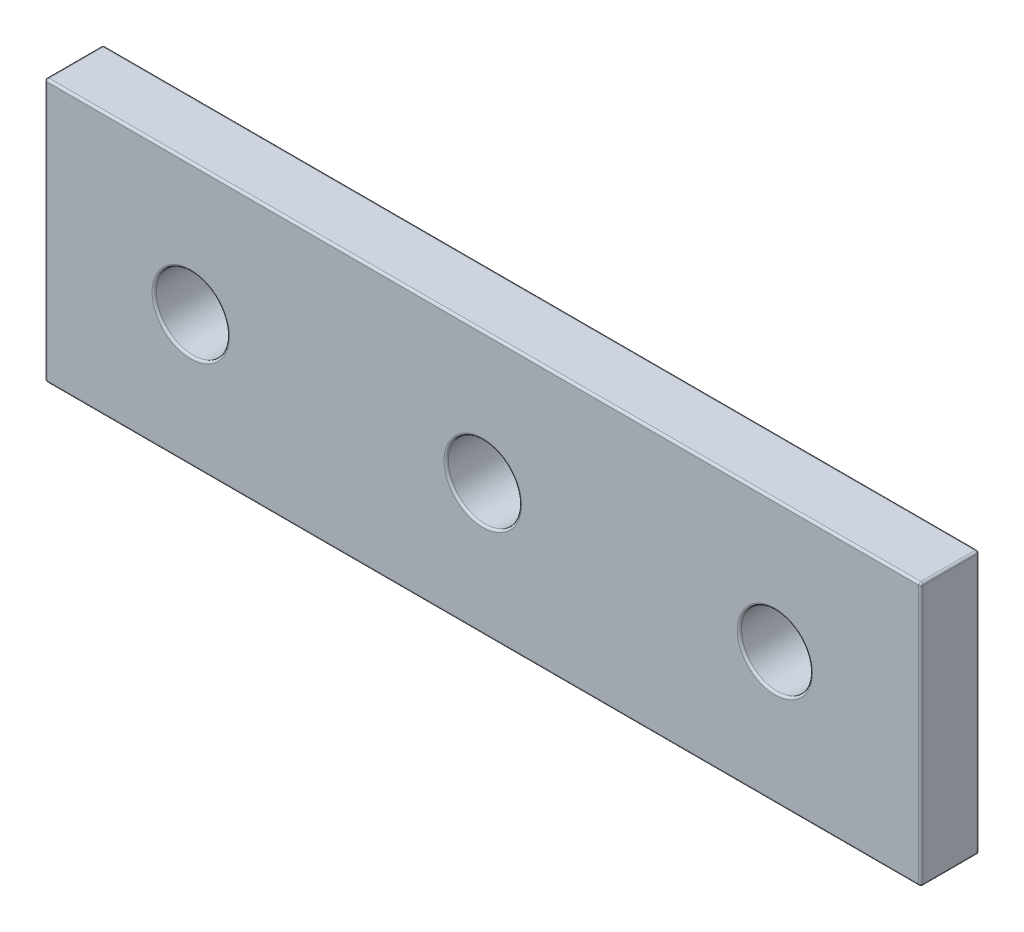
ISO-10303-21;
HEADER;
FILE_DESCRIPTION(('STEP AP214'),'2;1');
FILE_NAME('part.step','',(''),(''),'','','');
FILE_SCHEMA(('AUTOMOTIVE_DESIGN { 1 0 10303 214 1 1 1 1 }'));
ENDSEC;
DATA;
#1=APPLICATION_CONTEXT('core data for automotive mechanical design processes');
#2=APPLICATION_PROTOCOL_DEFINITION('international standard','automotive_design',2000,#1);
#3=PRODUCT_CONTEXT('',#1,'mechanical');
#4=PRODUCT('Part','Part','',(#3));
#5=PRODUCT_RELATED_PRODUCT_CATEGORY('part','',(#4));
#6=PRODUCT_DEFINITION_FORMATION('','',#4);
#7=PRODUCT_DEFINITION_CONTEXT('part definition',#1,'design');
#8=PRODUCT_DEFINITION('design','',#6,#7);
#9=PRODUCT_DEFINITION_SHAPE('','',#8);
#10=(LENGTH_UNIT() NAMED_UNIT(*) SI_UNIT(.MILLI.,.METRE.));
#11=(NAMED_UNIT(*) PLANE_ANGLE_UNIT() SI_UNIT($,.RADIAN.));
#12=(NAMED_UNIT(*) SI_UNIT($,.STERADIAN.) SOLID_ANGLE_UNIT());
#13=UNCERTAINTY_MEASURE_WITH_UNIT(LENGTH_MEASURE(1.E-05),#10,'distance_accuracy_value','');
#14=(GEOMETRIC_REPRESENTATION_CONTEXT(3) GLOBAL_UNCERTAINTY_ASSIGNED_CONTEXT((#13)) GLOBAL_UNIT_ASSIGNED_CONTEXT((#10,
#11,#12)) REPRESENTATION_CONTEXT('',''));
#15=CARTESIAN_POINT('',(0.,0.,0.));
#16=DIRECTION('',(0.,0.,1.));
#17=DIRECTION('',(1.,0.,0.));
#18=AXIS2_PLACEMENT_3D('',#15,#16,#17);
#19=CARTESIAN_POINT('',(0.,0.,4.));
#20=DIRECTION('',(0.,0.,1.));
#21=DIRECTION('',(1.,0.,0.));
#22=AXIS2_PLACEMENT_3D('',#19,#20,#21);
#23=PLANE('',#22);
#24=CARTESIAN_POINT('',(20.,0.,4.));
#25=DIRECTION('',(0.,0.,1.));
#26=DIRECTION('',(1.,0.,0.));
#27=AXIS2_PLACEMENT_3D('',#24,#25,#26);
#28=CIRCLE('',#27,2.5758241682766);
#29=CARTESIAN_POINT('',(22.5758241682766,0.,4.));
#30=VERTEX_POINT('',#29);
#31=EDGE_CURVE('E12',#30,#30,#28,.F.);
#32=ORIENTED_EDGE('',*,*,#31,.T.);
#33=EDGE_LOOP('',(#32));
#34=FACE_BOUND('',#33,.T.);
#35=CARTESIAN_POINT('',(0.,0.,4.));
#36=DIRECTION('',(0.,0.,1.));
#37=DIRECTION('',(1.,0.,0.));
#38=AXIS2_PLACEMENT_3D('',#35,#36,#37);
#39=CIRCLE('',#38,2.65);
#40=CARTESIAN_POINT('',(2.65,0.,4.));
#41=VERTEX_POINT('',#40);
#42=EDGE_CURVE('E87',#41,#41,#39,.F.);
#43=ORIENTED_EDGE('',*,*,#42,.T.);
#44=EDGE_LOOP('',(#43));
#45=FACE_BOUND('',#44,.T.);
#46=DIRECTION('',(0.,-1.,0.));
#47=VECTOR('',#46,1.);
#48=CARTESIAN_POINT('',(29.85,0.,4.));
#49=LINE('',#48,#47);
#50=CARTESIAN_POINT('',(29.85,-8.85,4.));
#51=VERTEX_POINT('',#50);
#52=CARTESIAN_POINT('',(29.85,8.85,4.));
#53=VERTEX_POINT('',#52);
#54=EDGE_CURVE('E95',#51,#53,#49,.F.);
#55=ORIENTED_EDGE('',*,*,#54,.T.);
#56=DIRECTION('',(1.,0.,0.));
#57=VECTOR('',#56,1.);
#58=CARTESIAN_POINT('',(0.,8.85,4.));
#59=LINE('',#58,#57);
#60=CARTESIAN_POINT('',(-29.85,8.85,4.));
#61=VERTEX_POINT('',#60);
#62=EDGE_CURVE('E276',#53,#61,#59,.F.);
#63=ORIENTED_EDGE('',*,*,#62,.T.);
#64=DIRECTION('',(0.,-1.,0.));
#65=VECTOR('',#64,1.);
#66=CARTESIAN_POINT('',(-29.85,-9.,4.));
#67=LINE('',#66,#65);
#68=CARTESIAN_POINT('',(-29.85,-8.85,4.));
#69=VERTEX_POINT('',#68);
#70=EDGE_CURVE('E272',#61,#69,#67,.T.);
#71=ORIENTED_EDGE('',*,*,#70,.T.);
#72=DIRECTION('',(1.,0.,0.));
#73=VECTOR('',#72,1.);
#74=CARTESIAN_POINT('',(30.,-8.85,4.));
#75=LINE('',#74,#73);
#76=EDGE_CURVE('E100',#69,#51,#75,.T.);
#77=ORIENTED_EDGE('',*,*,#76,.T.);
#78=EDGE_LOOP('',(#55,#63,#71,#77));
#79=FACE_BOUND('',#78,.T.);
#80=CARTESIAN_POINT('',(-20.,0.,4.));
#81=DIRECTION('',(0.,0.,1.));
#82=DIRECTION('',(1.,0.,0.));
#83=AXIS2_PLACEMENT_3D('',#80,#81,#82);
#84=CIRCLE('',#83,2.65);
#85=CARTESIAN_POINT('',(-17.35,0.,4.));
#86=VERTEX_POINT('',#85);
#87=EDGE_CURVE('E269',#86,#86,#84,.F.);
#88=ORIENTED_EDGE('',*,*,#87,.T.);
#89=EDGE_LOOP('',(#88));
#90=FACE_BOUND('',#89,.T.);
#91=ADVANCED_FACE('F78',(#34,#45,#79,#90),#23,.T.);
#92=CARTESIAN_POINT('',(0.,0.,0.));
#93=DIRECTION('',(0.,0.,1.));
#94=DIRECTION('',(1.,0.,0.));
#95=AXIS2_PLACEMENT_3D('',#92,#93,#94);
#96=PLANE('',#95);
#97=CARTESIAN_POINT('',(20.,0.,0.));
#98=DIRECTION('',(0.,0.,1.));
#99=DIRECTION('',(1.,0.,0.));
#100=AXIS2_PLACEMENT_3D('',#97,#98,#99);
#101=CIRCLE('',#100,2.5758241682766);
#102=CARTESIAN_POINT('',(22.5758241682766,0.,0.));
#103=VERTEX_POINT('',#102);
#104=EDGE_CURVE('E210',#103,#103,#101,.T.);
#105=ORIENTED_EDGE('',*,*,#104,.T.);
#106=EDGE_LOOP('',(#105));
#107=FACE_BOUND('',#106,.T.);
#108=CARTESIAN_POINT('',(0.,0.,0.));
#109=DIRECTION('',(0.,0.,1.));
#110=DIRECTION('',(1.,0.,0.));
#111=AXIS2_PLACEMENT_3D('',#108,#109,#110);
#112=CIRCLE('',#111,2.65);
#113=CARTESIAN_POINT('',(2.65,0.,0.));
#114=VERTEX_POINT('',#113);
#115=EDGE_CURVE('E207',#114,#114,#112,.T.);
#116=ORIENTED_EDGE('',*,*,#115,.T.);
#117=EDGE_LOOP('',(#116));
#118=FACE_BOUND('',#117,.T.);
#119=DIRECTION('',(0.,-1.,0.));
#120=VECTOR('',#119,1.);
#121=CARTESIAN_POINT('',(29.85,-9.,0.));
#122=LINE('',#121,#120);
#123=CARTESIAN_POINT('',(29.85,8.85,0.));
#124=VERTEX_POINT('',#123);
#125=CARTESIAN_POINT('',(29.85,-8.85,0.));
#126=VERTEX_POINT('',#125);
#127=EDGE_CURVE('E205',#124,#126,#122,.T.);
#128=ORIENTED_EDGE('',*,*,#127,.T.);
#129=DIRECTION('',(1.,0.,0.));
#130=VECTOR('',#129,1.);
#131=CARTESIAN_POINT('',(0.,-8.85,0.));
#132=LINE('',#131,#130);
#133=CARTESIAN_POINT('',(-29.85,-8.85,0.));
#134=VERTEX_POINT('',#133);
#135=EDGE_CURVE('E173',#126,#134,#132,.F.);
#136=ORIENTED_EDGE('',*,*,#135,.T.);
#137=DIRECTION('',(0.,-1.,0.));
#138=VECTOR('',#137,1.);
#139=CARTESIAN_POINT('',(-29.85,0.,0.));
#140=LINE('',#139,#138);
#141=CARTESIAN_POINT('',(-29.85,8.85,0.));
#142=VERTEX_POINT('',#141);
#143=EDGE_CURVE('E193',#134,#142,#140,.F.);
#144=ORIENTED_EDGE('',*,*,#143,.T.);
#145=DIRECTION('',(1.,0.,0.));
#146=VECTOR('',#145,1.);
#147=CARTESIAN_POINT('',(30.,8.85,0.));
#148=LINE('',#147,#146);
#149=EDGE_CURVE('E199',#142,#124,#148,.T.);
#150=ORIENTED_EDGE('',*,*,#149,.T.);
#151=EDGE_LOOP('',(#128,#136,#144,#150));
#152=FACE_BOUND('',#151,.T.);
#153=CARTESIAN_POINT('',(-20.,0.,0.));
#154=DIRECTION('',(0.,0.,1.));
#155=DIRECTION('',(1.,0.,0.));
#156=AXIS2_PLACEMENT_3D('',#153,#154,#155);
#157=CIRCLE('',#156,2.65);
#158=CARTESIAN_POINT('',(-17.35,0.,0.));
#159=VERTEX_POINT('',#158);
#160=EDGE_CURVE('E200',#159,#159,#157,.T.);
#161=ORIENTED_EDGE('',*,*,#160,.T.);
#162=EDGE_LOOP('',(#161));
#163=FACE_BOUND('',#162,.T.);
#164=ADVANCED_FACE('F202',(#107,#118,#152,#163),#96,.F.);
#165=CARTESIAN_POINT('',(-30.,9.,4.));
#166=DIRECTION('',(1.,0.,0.));
#167=DIRECTION('',(0.,0.,-1.));
#168=AXIS2_PLACEMENT_3D('',#165,#166,#167);
#169=PLANE('',#168);
#170=DIRECTION('',(0.,-1.,0.));
#171=VECTOR('',#170,1.);
#172=CARTESIAN_POINT('',(-30.,9.,3.85));
#173=LINE('',#172,#171);
#174=CARTESIAN_POINT('',(-30.,-8.85,3.85));
#175=VERTEX_POINT('',#174);
#176=CARTESIAN_POINT('',(-30.,8.85,3.85));
#177=VERTEX_POINT('',#176);
#178=EDGE_CURVE('E256',#175,#177,#173,.F.);
#179=ORIENTED_EDGE('',*,*,#178,.T.);
#180=DIRECTION('',(0.,0.,-1.));
#181=VECTOR('',#180,1.);
#182=CARTESIAN_POINT('',(-30.,8.85,0.));
#183=LINE('',#182,#181);
#184=CARTESIAN_POINT('',(-30.,8.85,0.15));
#185=VERTEX_POINT('',#184);
#186=EDGE_CURVE('E261',#177,#185,#183,.T.);
#187=ORIENTED_EDGE('',*,*,#186,.T.);
#188=DIRECTION('',(0.,-1.,0.));
#189=VECTOR('',#188,1.);
#190=CARTESIAN_POINT('',(-30.,9.,0.15));
#191=LINE('',#190,#189);
#192=CARTESIAN_POINT('',(-30.,-8.85,0.15));
#193=VERTEX_POINT('',#192);
#194=EDGE_CURVE('E258',#185,#193,#191,.T.);
#195=ORIENTED_EDGE('',*,*,#194,.T.);
#196=DIRECTION('',(0.,0.,-1.));
#197=VECTOR('',#196,1.);
#198=CARTESIAN_POINT('',(-30.,-8.85,4.));
#199=LINE('',#198,#197);
#200=EDGE_CURVE('E254',#193,#175,#199,.F.);
#201=ORIENTED_EDGE('',*,*,#200,.T.);
#202=EDGE_LOOP('',(#179,#187,#195,#201));
#203=FACE_BOUND('',#202,.T.);
#204=ADVANCED_FACE('F374',(#203),#169,.F.);
#205=CARTESIAN_POINT('',(-30.,-9.,4.));
#206=DIRECTION('',(0.,1.,0.));
#207=DIRECTION('',(0.,0.,1.));
#208=AXIS2_PLACEMENT_3D('',#205,#206,#207);
#209=PLANE('',#208);
#210=DIRECTION('',(1.,0.,0.));
#211=VECTOR('',#210,1.);
#212=CARTESIAN_POINT('',(-30.,-9.,3.85));
#213=LINE('',#212,#211);
#214=CARTESIAN_POINT('',(29.85,-9.,3.85));
#215=VERTEX_POINT('',#214);
#216=CARTESIAN_POINT('',(-29.85,-9.,3.85));
#217=VERTEX_POINT('',#216);
#218=EDGE_CURVE('E231',#215,#217,#213,.F.);
#219=ORIENTED_EDGE('',*,*,#218,.T.);
#220=DIRECTION('',(0.,0.,-1.));
#221=VECTOR('',#220,1.);
#222=CARTESIAN_POINT('',(-29.85,-9.,4.));
#223=LINE('',#222,#221);
#224=CARTESIAN_POINT('',(-29.85,-9.,0.15));
#225=VERTEX_POINT('',#224);
#226=EDGE_CURVE('E234',#217,#225,#223,.T.);
#227=ORIENTED_EDGE('',*,*,#226,.T.);
#228=DIRECTION('',(1.,0.,0.));
#229=VECTOR('',#228,1.);
#230=CARTESIAN_POINT('',(-30.,-9.,0.15));
#231=LINE('',#230,#229);
#232=CARTESIAN_POINT('',(29.85,-9.,0.15));
#233=VERTEX_POINT('',#232);
#234=EDGE_CURVE('E176',#225,#233,#231,.T.);
#235=ORIENTED_EDGE('',*,*,#234,.T.);
#236=DIRECTION('',(0.,0.,-1.));
#237=VECTOR('',#236,1.);
#238=CARTESIAN_POINT('',(29.85,-9.,4.));
#239=LINE('',#238,#237);
#240=EDGE_CURVE('E229',#233,#215,#239,.F.);
#241=ORIENTED_EDGE('',*,*,#240,.T.);
#242=EDGE_LOOP('',(#219,#227,#235,#241));
#243=FACE_BOUND('',#242,.T.);
#244=ADVANCED_FACE('F366',(#243),#209,.F.);
#245=CARTESIAN_POINT('',(30.,9.,4.));
#246=DIRECTION('',(1.,0.,0.));
#247=DIRECTION('',(0.,0.,-1.));
#248=AXIS2_PLACEMENT_3D('',#245,#246,#247);
#249=PLANE('',#248);
#250=DIRECTION('',(0.,-1.,0.));
#251=VECTOR('',#250,1.);
#252=CARTESIAN_POINT('',(30.,9.,3.85));
#253=LINE('',#252,#251);
#254=CARTESIAN_POINT('',(30.,8.85,3.85));
#255=VERTEX_POINT('',#254);
#256=CARTESIAN_POINT('',(30.,-8.85,3.85));
#257=VERTEX_POINT('',#256);
#258=EDGE_CURVE('E238',#255,#257,#253,.T.);
#259=ORIENTED_EDGE('',*,*,#258,.T.);
#260=DIRECTION('',(0.,0.,-1.));
#261=VECTOR('',#260,1.);
#262=CARTESIAN_POINT('',(30.,-8.85,0.));
#263=LINE('',#262,#261);
#264=CARTESIAN_POINT('',(30.,-8.85,0.15));
#265=VERTEX_POINT('',#264);
#266=EDGE_CURVE('E243',#257,#265,#263,.T.);
#267=ORIENTED_EDGE('',*,*,#266,.T.);
#268=DIRECTION('',(0.,-1.,0.));
#269=VECTOR('',#268,1.);
#270=CARTESIAN_POINT('',(30.,9.,0.15));
#271=LINE('',#270,#269);
#272=CARTESIAN_POINT('',(30.,8.85,0.15));
#273=VERTEX_POINT('',#272);
#274=EDGE_CURVE('E240',#265,#273,#271,.F.);
#275=ORIENTED_EDGE('',*,*,#274,.T.);
#276=DIRECTION('',(0.,0.,-1.));
#277=VECTOR('',#276,1.);
#278=CARTESIAN_POINT('',(30.,8.85,4.));
#279=LINE('',#278,#277);
#280=EDGE_CURVE('E236',#273,#255,#279,.F.);
#281=ORIENTED_EDGE('',*,*,#280,.T.);
#282=EDGE_LOOP('',(#259,#267,#275,#281));
#283=FACE_BOUND('',#282,.T.);
#284=ADVANCED_FACE('F410',(#283),#249,.T.);
#285=CARTESIAN_POINT('',(-30.,9.,4.));
#286=DIRECTION('',(0.,1.,0.));
#287=DIRECTION('',(0.,0.,1.));
#288=AXIS2_PLACEMENT_3D('',#285,#286,#287);
#289=PLANE('',#288);
#290=DIRECTION('',(1.,0.,0.));
#291=VECTOR('',#290,1.);
#292=CARTESIAN_POINT('',(-30.,9.,0.15));
#293=LINE('',#292,#291);
#294=CARTESIAN_POINT('',(29.85,9.,0.15));
#295=VERTEX_POINT('',#294);
#296=CARTESIAN_POINT('',(-29.85,9.,0.15));
#297=VERTEX_POINT('',#296);
#298=EDGE_CURVE('E249',#295,#297,#293,.F.);
#299=ORIENTED_EDGE('',*,*,#298,.T.);
#300=DIRECTION('',(0.,0.,-1.));
#301=VECTOR('',#300,1.);
#302=CARTESIAN_POINT('',(-29.85,9.,4.));
#303=LINE('',#302,#301);
#304=CARTESIAN_POINT('',(-29.85,9.,3.85));
#305=VERTEX_POINT('',#304);
#306=EDGE_CURVE('E252',#297,#305,#303,.F.);
#307=ORIENTED_EDGE('',*,*,#306,.T.);
#308=DIRECTION('',(1.,0.,0.));
#309=VECTOR('',#308,1.);
#310=CARTESIAN_POINT('',(-30.,9.,3.85));
#311=LINE('',#310,#309);
#312=CARTESIAN_POINT('',(29.85,9.,3.85));
#313=VERTEX_POINT('',#312);
#314=EDGE_CURVE('E247',#305,#313,#311,.T.);
#315=ORIENTED_EDGE('',*,*,#314,.T.);
#316=DIRECTION('',(0.,0.,-1.));
#317=VECTOR('',#316,1.);
#318=CARTESIAN_POINT('',(29.85,9.,4.));
#319=LINE('',#318,#317);
#320=EDGE_CURVE('E245',#313,#295,#319,.T.);
#321=ORIENTED_EDGE('',*,*,#320,.T.);
#322=EDGE_LOOP('',(#299,#307,#315,#321));
#323=FACE_BOUND('',#322,.T.);
#324=ADVANCED_FACE('F407',(#323),#289,.T.);
#325=CARTESIAN_POINT('',(0.,0.,4.));
#326=DIRECTION('',(0.,0.,-1.));
#327=DIRECTION('',(-1.,0.,0.));
#328=AXIS2_PLACEMENT_3D('',#325,#326,#327);
#329=CYLINDRICAL_SURFACE('',#328,2.5);
#330=CARTESIAN_POINT('',(0.,0.,0.15));
#331=DIRECTION('',(0.,0.,1.));
#332=DIRECTION('',(1.,0.,0.));
#333=AXIS2_PLACEMENT_3D('',#330,#331,#332);
#334=CIRCLE('',#333,2.5);
#335=CARTESIAN_POINT('',(2.5,0.,0.15));
#336=VERTEX_POINT('',#335);
#337=EDGE_CURVE('E226',#336,#336,#334,.F.);
#338=ORIENTED_EDGE('',*,*,#337,.T.);
#339=EDGE_LOOP('',(#338));
#340=FACE_BOUND('',#339,.T.);
#341=CARTESIAN_POINT('',(0.,0.,3.85));
#342=DIRECTION('',(0.,0.,1.));
#343=DIRECTION('',(1.,0.,0.));
#344=AXIS2_PLACEMENT_3D('',#341,#342,#343);
#345=CIRCLE('',#344,2.5);
#346=CARTESIAN_POINT('',(2.5,0.,3.85));
#347=VERTEX_POINT('',#346);
#348=EDGE_CURVE('E223',#347,#347,#345,.T.);
#349=ORIENTED_EDGE('',*,*,#348,.T.);
#350=EDGE_LOOP('',(#349));
#351=FACE_BOUND('',#350,.T.);
#352=ADVANCED_FACE('F404',(#340,#351),#329,.F.);
#353=CARTESIAN_POINT('',(-20.,0.,4.));
#354=DIRECTION('',(0.,0.,-1.));
#355=DIRECTION('',(-1.,0.,0.));
#356=AXIS2_PLACEMENT_3D('',#353,#354,#355);
#357=CYLINDRICAL_SURFACE('',#356,2.5);
#358=CARTESIAN_POINT('',(-20.,0.,0.15));
#359=DIRECTION('',(0.,0.,1.));
#360=DIRECTION('',(1.,0.,0.));
#361=AXIS2_PLACEMENT_3D('',#358,#359,#360);
#362=CIRCLE('',#361,2.5);
#363=CARTESIAN_POINT('',(-17.5,0.,0.15));
#364=VERTEX_POINT('',#363);
#365=EDGE_CURVE('E266',#364,#364,#362,.F.);
#366=ORIENTED_EDGE('',*,*,#365,.T.);
#367=EDGE_LOOP('',(#366));
#368=FACE_BOUND('',#367,.T.);
#369=CARTESIAN_POINT('',(-20.,0.,3.85));
#370=DIRECTION('',(0.,0.,1.));
#371=DIRECTION('',(1.,0.,0.));
#372=AXIS2_PLACEMENT_3D('',#369,#370,#371);
#373=CIRCLE('',#372,2.5);
#374=CARTESIAN_POINT('',(-17.5,0.,3.85));
#375=VERTEX_POINT('',#374);
#376=EDGE_CURVE('E263',#375,#375,#373,.T.);
#377=ORIENTED_EDGE('',*,*,#376,.T.);
#378=EDGE_LOOP('',(#377));
#379=FACE_BOUND('',#378,.T.);
#380=ADVANCED_FACE('F491',(#368,#379),#357,.F.);
#381=CARTESIAN_POINT('',(20.,0.,4.));
#382=DIRECTION('',(0.,0.,-1.));
#383=DIRECTION('',(-1.,0.,0.));
#384=AXIS2_PLACEMENT_3D('',#381,#382,#383);
#385=CYLINDRICAL_SURFACE('',#384,2.4258241682766);
#386=CARTESIAN_POINT('',(20.,0.,0.15));
#387=DIRECTION('',(0.,0.,1.));
#388=DIRECTION('',(1.,0.,0.));
#389=AXIS2_PLACEMENT_3D('',#386,#387,#388);
#390=CIRCLE('',#389,2.4258241682766);
#391=CARTESIAN_POINT('',(22.4258241682766,0.,0.15));
#392=VERTEX_POINT('',#391);
#393=EDGE_CURVE('E220',#392,#392,#390,.F.);
#394=ORIENTED_EDGE('',*,*,#393,.T.);
#395=EDGE_LOOP('',(#394));
#396=FACE_BOUND('',#395,.T.);
#397=CARTESIAN_POINT('',(20.,0.,3.85));
#398=DIRECTION('',(0.,0.,1.));
#399=DIRECTION('',(1.,0.,0.));
#400=AXIS2_PLACEMENT_3D('',#397,#398,#399);
#401=CIRCLE('',#400,2.4258241682766);
#402=CARTESIAN_POINT('',(22.4258241682766,0.,3.85));
#403=VERTEX_POINT('',#402);
#404=EDGE_CURVE('E217',#403,#403,#401,.T.);
#405=ORIENTED_EDGE('',*,*,#404,.T.);
#406=EDGE_LOOP('',(#405));
#407=FACE_BOUND('',#406,.T.);
#408=ADVANCED_FACE('F423',(#396,#407),#385,.F.);
#409=CARTESIAN_POINT('',(20.,0.,0.15));
#410=DIRECTION('',(0.,0.,1.));
#411=DIRECTION('',(1.,0.,0.));
#412=AXIS2_PLACEMENT_3D('',#409,#410,#411);
#413=TOROIDAL_SURFACE('',#412,2.5758241682766,0.15);
#414=ORIENTED_EDGE('',*,*,#393,.F.);
#415=EDGE_LOOP('',(#414));
#416=FACE_BOUND('',#415,.T.);
#417=ORIENTED_EDGE('',*,*,#104,.F.);
#418=EDGE_LOOP('',(#417));
#419=FACE_BOUND('',#418,.T.);
#420=ADVANCED_FACE('F419',(#416,#419),#413,.T.);
#421=CARTESIAN_POINT('',(0.,0.,0.15));
#422=DIRECTION('',(0.,0.,1.));
#423=DIRECTION('',(1.,0.,0.));
#424=AXIS2_PLACEMENT_3D('',#421,#422,#423);
#425=TOROIDAL_SURFACE('',#424,2.65,0.15);
#426=ORIENTED_EDGE('',*,*,#337,.F.);
#427=EDGE_LOOP('',(#426));
#428=FACE_BOUND('',#427,.T.);
#429=ORIENTED_EDGE('',*,*,#115,.F.);
#430=EDGE_LOOP('',(#429));
#431=FACE_BOUND('',#430,.T.);
#432=ADVANCED_FACE('F422',(#428,#431),#425,.T.);
#433=CARTESIAN_POINT('',(-30.,8.85,3.85));
#434=DIRECTION('',(1.,0.,0.));
#435=DIRECTION('',(0.,0.,-1.));
#436=AXIS2_PLACEMENT_3D('',#433,#434,#435);
#437=CYLINDRICAL_SURFACE('',#436,0.15);
#438=CARTESIAN_POINT('',(-29.85,8.85,3.85));
#439=DIRECTION('',(-1.,0.,0.));
#440=DIRECTION('',(0.,0.,1.));
#441=AXIS2_PLACEMENT_3D('',#438,#439,#440);
#442=CIRCLE('',#441,0.15);
#443=EDGE_CURVE('E82',#61,#305,#442,.T.);
#444=ORIENTED_EDGE('',*,*,#443,.F.);
#445=ORIENTED_EDGE('',*,*,#62,.F.);
#446=CARTESIAN_POINT('',(29.85,8.85,3.85));
#447=DIRECTION('',(1.,0.,0.));
#448=DIRECTION('',(0.,0.,-1.));
#449=AXIS2_PLACEMENT_3D('',#446,#447,#448);
#450=CIRCLE('',#449,0.15);
#451=EDGE_CURVE('E329',#313,#53,#450,.T.);
#452=ORIENTED_EDGE('',*,*,#451,.F.);
#453=ORIENTED_EDGE('',*,*,#314,.F.);
#454=EDGE_LOOP('',(#444,#445,#452,#453));
#455=FACE_BOUND('',#454,.T.);
#456=ADVANCED_FACE('F427',(#455),#437,.T.);
#457=CARTESIAN_POINT('',(-29.85,8.85,3.85));
#458=DIRECTION('',(0.,0.,1.));
#459=DIRECTION('',(1.,0.,0.));
#460=AXIS2_PLACEMENT_3D('',#457,#458,#459);
#461=SPHERICAL_SURFACE('',#460,0.15);
#462=CARTESIAN_POINT('',(-29.85,8.85,3.85));
#463=DIRECTION('',(0.,1.,0.));
#464=DIRECTION('',(0.,0.,1.));
#465=AXIS2_PLACEMENT_3D('',#462,#463,#464);
#466=CIRCLE('',#465,0.15);
#467=EDGE_CURVE('E324',#61,#177,#466,.F.);
#468=ORIENTED_EDGE('',*,*,#467,.F.);
#469=ORIENTED_EDGE('',*,*,#443,.T.);
#470=CARTESIAN_POINT('',(-29.85,8.85,3.85));
#471=DIRECTION('',(0.,0.,1.));
#472=DIRECTION('',(1.,0.,0.));
#473=AXIS2_PLACEMENT_3D('',#470,#471,#472);
#474=CIRCLE('',#473,0.15);
#475=EDGE_CURVE('E327',#177,#305,#474,.F.);
#476=ORIENTED_EDGE('',*,*,#475,.F.);
#477=EDGE_LOOP('',(#468,#469,#476));
#478=FACE_BOUND('',#477,.T.);
#479=ADVANCED_FACE('F460',(#478),#461,.T.);
#480=CARTESIAN_POINT('',(29.85,8.85,3.85));
#481=DIRECTION('',(0.,0.,1.));
#482=DIRECTION('',(1.,0.,0.));
#483=AXIS2_PLACEMENT_3D('',#480,#481,#482);
#484=SPHERICAL_SURFACE('',#483,0.15);
#485=CARTESIAN_POINT('',(29.85,8.85,3.85));
#486=DIRECTION('',(0.,0.,1.));
#487=DIRECTION('',(1.,0.,0.));
#488=AXIS2_PLACEMENT_3D('',#485,#486,#487);
#489=CIRCLE('',#488,0.15);
#490=EDGE_CURVE('E318',#313,#255,#489,.F.);
#491=ORIENTED_EDGE('',*,*,#490,.F.);
#492=ORIENTED_EDGE('',*,*,#451,.T.);
#493=CARTESIAN_POINT('',(29.85,8.85,3.85));
#494=DIRECTION('',(0.,1.,0.));
#495=DIRECTION('',(0.,0.,1.));
#496=AXIS2_PLACEMENT_3D('',#493,#494,#495);
#497=CIRCLE('',#496,0.15);
#498=EDGE_CURVE('E321',#255,#53,#497,.F.);
#499=ORIENTED_EDGE('',*,*,#498,.F.);
#500=EDGE_LOOP('',(#491,#492,#499));
#501=FACE_BOUND('',#500,.T.);
#502=ADVANCED_FACE('F462',(#501),#484,.T.);
#503=CARTESIAN_POINT('',(-29.85,8.85,4.));
#504=DIRECTION('',(0.,0.,1.));
#505=DIRECTION('',(1.,0.,0.));
#506=AXIS2_PLACEMENT_3D('',#503,#504,#505);
#507=CYLINDRICAL_SURFACE('',#506,0.15);
#508=ORIENTED_EDGE('',*,*,#475,.T.);
#509=ORIENTED_EDGE('',*,*,#306,.F.);
#510=CARTESIAN_POINT('',(-29.85,8.85,0.15));
#511=DIRECTION('',(0.,0.,-1.));
#512=DIRECTION('',(0.,1.,0.));
#513=AXIS2_PLACEMENT_3D('',#510,#511,#512);
#514=CIRCLE('',#513,0.15);
#515=EDGE_CURVE('E313',#185,#297,#514,.T.);
#516=ORIENTED_EDGE('',*,*,#515,.F.);
#517=ORIENTED_EDGE('',*,*,#186,.F.);
#518=EDGE_LOOP('',(#508,#509,#516,#517));
#519=FACE_BOUND('',#518,.T.);
#520=ADVANCED_FACE('F379',(#519),#507,.T.);
#521=CARTESIAN_POINT('',(-29.85,0.,3.85));
#522=DIRECTION('',(0.,1.,0.));
#523=DIRECTION('',(0.,0.,1.));
#524=AXIS2_PLACEMENT_3D('',#521,#522,#523);
#525=CYLINDRICAL_SURFACE('',#524,0.15);
#526=ORIENTED_EDGE('',*,*,#467,.T.);
#527=ORIENTED_EDGE('',*,*,#178,.F.);
#528=CARTESIAN_POINT('',(-29.85,-8.85,3.85));
#529=DIRECTION('',(0.,-1.,0.));
#530=DIRECTION('',(0.,0.,-1.));
#531=AXIS2_PLACEMENT_3D('',#528,#529,#530);
#532=CIRCLE('',#531,0.15);
#533=EDGE_CURVE('E310',#69,#175,#532,.T.);
#534=ORIENTED_EDGE('',*,*,#533,.F.);
#535=ORIENTED_EDGE('',*,*,#70,.F.);
#536=EDGE_LOOP('',(#526,#527,#534,#535));
#537=FACE_BOUND('',#536,.T.);
#538=ADVANCED_FACE('F459',(#537),#525,.T.);
#539=CARTESIAN_POINT('',(0.,-8.85,3.85));
#540=DIRECTION('',(-1.,0.,0.));
#541=DIRECTION('',(0.,0.,1.));
#542=AXIS2_PLACEMENT_3D('',#539,#540,#541);
#543=CYLINDRICAL_SURFACE('',#542,0.15);
#544=CARTESIAN_POINT('',(29.85,-8.85,3.85));
#545=DIRECTION('',(1.,0.,0.));
#546=DIRECTION('',(0.,0.,-1.));
#547=AXIS2_PLACEMENT_3D('',#544,#545,#546);
#548=CIRCLE('',#547,0.15);
#549=EDGE_CURVE('E304',#51,#215,#548,.T.);
#550=ORIENTED_EDGE('',*,*,#549,.F.);
#551=ORIENTED_EDGE('',*,*,#76,.F.);
#552=CARTESIAN_POINT('',(-29.85,-8.85,3.85));
#553=DIRECTION('',(-1.,0.,0.));
#554=DIRECTION('',(0.,0.,1.));
#555=AXIS2_PLACEMENT_3D('',#552,#553,#554);
#556=CIRCLE('',#555,0.15);
#557=EDGE_CURVE('E307',#217,#69,#556,.T.);
#558=ORIENTED_EDGE('',*,*,#557,.F.);
#559=ORIENTED_EDGE('',*,*,#218,.F.);
#560=EDGE_LOOP('',(#550,#551,#558,#559));
#561=FACE_BOUND('',#560,.T.);
#562=ADVANCED_FACE('F456',(#561),#543,.T.);
#563=CARTESIAN_POINT('',(29.85,9.,3.85));
#564=DIRECTION('',(0.,-1.,0.));
#565=DIRECTION('',(0.,0.,-1.));
#566=AXIS2_PLACEMENT_3D('',#563,#564,#565);
#567=CYLINDRICAL_SURFACE('',#566,0.15);
#568=ORIENTED_EDGE('',*,*,#498,.T.);
#569=ORIENTED_EDGE('',*,*,#54,.F.);
#570=CARTESIAN_POINT('',(29.85,-8.85,3.85));
#571=DIRECTION('',(0.,-1.,0.));
#572=DIRECTION('',(0.,0.,-1.));
#573=AXIS2_PLACEMENT_3D('',#570,#571,#572);
#574=CIRCLE('',#573,0.15);
#575=EDGE_CURVE('E301',#257,#51,#574,.T.);
#576=ORIENTED_EDGE('',*,*,#575,.F.);
#577=ORIENTED_EDGE('',*,*,#258,.F.);
#578=EDGE_LOOP('',(#568,#569,#576,#577));
#579=FACE_BOUND('',#578,.T.);
#580=ADVANCED_FACE('F454',(#579),#567,.T.);
#581=CARTESIAN_POINT('',(29.85,8.85,4.));
#582=DIRECTION('',(0.,0.,-1.));
#583=DIRECTION('',(-1.,0.,0.));
#584=AXIS2_PLACEMENT_3D('',#581,#582,#583);
#585=CYLINDRICAL_SURFACE('',#584,0.15);
#586=ORIENTED_EDGE('',*,*,#490,.T.);
#587=ORIENTED_EDGE('',*,*,#280,.F.);
#588=CARTESIAN_POINT('',(29.85,8.85,0.15));
#589=DIRECTION('',(0.,0.,-1.));
#590=DIRECTION('',(-1.,0.,0.));
#591=AXIS2_PLACEMENT_3D('',#588,#589,#590);
#592=CIRCLE('',#591,0.15);
#593=EDGE_CURVE('E298',#295,#273,#592,.T.);
#594=ORIENTED_EDGE('',*,*,#593,.F.);
#595=ORIENTED_EDGE('',*,*,#320,.F.);
#596=EDGE_LOOP('',(#586,#587,#594,#595));
#597=FACE_BOUND('',#596,.T.);
#598=ADVANCED_FACE('F392',(#597),#585,.T.);
#599=CARTESIAN_POINT('',(0.,8.85,0.15));
#600=DIRECTION('',(-1.,0.,0.));
#601=DIRECTION('',(0.,0.,1.));
#602=AXIS2_PLACEMENT_3D('',#599,#600,#601);
#603=CYLINDRICAL_SURFACE('',#602,0.15);
#604=CARTESIAN_POINT('',(-29.85,8.85,0.15));
#605=DIRECTION('',(-1.,0.,0.));
#606=DIRECTION('',(0.,0.,1.));
#607=AXIS2_PLACEMENT_3D('',#604,#605,#606);
#608=CIRCLE('',#607,0.15);
#609=EDGE_CURVE('E315',#297,#142,#608,.T.);
#610=ORIENTED_EDGE('',*,*,#609,.F.);
#611=ORIENTED_EDGE('',*,*,#298,.F.);
#612=CARTESIAN_POINT('',(29.85,8.85,0.15));
#613=DIRECTION('',(1.,0.,0.));
#614=DIRECTION('',(0.,1.,0.));
#615=AXIS2_PLACEMENT_3D('',#612,#613,#614);
#616=CIRCLE('',#615,0.15);
#617=EDGE_CURVE('E295',#124,#295,#616,.T.);
#618=ORIENTED_EDGE('',*,*,#617,.F.);
#619=ORIENTED_EDGE('',*,*,#149,.F.);
#620=EDGE_LOOP('',(#610,#611,#618,#619));
#621=FACE_BOUND('',#620,.T.);
#622=ADVANCED_FACE('F348',(#621),#603,.T.);
#623=CARTESIAN_POINT('',(-29.85,8.85,0.15));
#624=DIRECTION('',(0.,0.,1.));
#625=DIRECTION('',(1.,0.,0.));
#626=AXIS2_PLACEMENT_3D('',#623,#624,#625);
#627=SPHERICAL_SURFACE('',#626,0.15);
#628=ORIENTED_EDGE('',*,*,#515,.T.);
#629=ORIENTED_EDGE('',*,*,#609,.T.);
#630=CARTESIAN_POINT('',(-29.85,8.85,0.15));
#631=DIRECTION('',(0.,1.,0.));
#632=DIRECTION('',(0.,0.,1.));
#633=AXIS2_PLACEMENT_3D('',#630,#631,#632);
#634=CIRCLE('',#633,0.15);
#635=EDGE_CURVE('E196',#185,#142,#634,.F.);
#636=ORIENTED_EDGE('',*,*,#635,.F.);
#637=EDGE_LOOP('',(#628,#629,#636));
#638=FACE_BOUND('',#637,.T.);
#639=ADVANCED_FACE('F381',(#638),#627,.T.);
#640=CARTESIAN_POINT('',(-29.85,-8.85,3.85));
#641=DIRECTION('',(0.,0.,1.));
#642=DIRECTION('',(1.,0.,0.));
#643=AXIS2_PLACEMENT_3D('',#640,#641,#642);
#644=SPHERICAL_SURFACE('',#643,0.15);
#645=ORIENTED_EDGE('',*,*,#557,.T.);
#646=ORIENTED_EDGE('',*,*,#533,.T.);
#647=CARTESIAN_POINT('',(-29.85,-8.85,3.85));
#648=DIRECTION('',(0.,0.,1.));
#649=DIRECTION('',(1.,0.,0.));
#650=AXIS2_PLACEMENT_3D('',#647,#648,#649);
#651=CIRCLE('',#650,0.15);
#652=EDGE_CURVE('E291',#217,#175,#651,.F.);
#653=ORIENTED_EDGE('',*,*,#652,.F.);
#654=EDGE_LOOP('',(#645,#646,#653));
#655=FACE_BOUND('',#654,.T.);
#656=ADVANCED_FACE('F383',(#655),#644,.T.);
#657=CARTESIAN_POINT('',(29.85,-8.85,3.85));
#658=DIRECTION('',(0.,0.,1.));
#659=DIRECTION('',(1.,0.,0.));
#660=AXIS2_PLACEMENT_3D('',#657,#658,#659);
#661=SPHERICAL_SURFACE('',#660,0.15);
#662=ORIENTED_EDGE('',*,*,#575,.T.);
#663=ORIENTED_EDGE('',*,*,#549,.T.);
#664=CARTESIAN_POINT('',(29.85,-8.85,3.85));
#665=DIRECTION('',(0.,0.,1.));
#666=DIRECTION('',(1.,0.,0.));
#667=AXIS2_PLACEMENT_3D('',#664,#665,#666);
#668=CIRCLE('',#667,0.15);
#669=EDGE_CURVE('E288',#257,#215,#668,.F.);
#670=ORIENTED_EDGE('',*,*,#669,.F.);
#671=EDGE_LOOP('',(#662,#663,#670));
#672=FACE_BOUND('',#671,.T.);
#673=ADVANCED_FACE('F389',(#672),#661,.T.);
#674=CARTESIAN_POINT('',(29.85,8.85,0.15));
#675=DIRECTION('',(0.,0.,1.));
#676=DIRECTION('',(1.,0.,0.));
#677=AXIS2_PLACEMENT_3D('',#674,#675,#676);
#678=SPHERICAL_SURFACE('',#677,0.15);
#679=ORIENTED_EDGE('',*,*,#617,.T.);
#680=ORIENTED_EDGE('',*,*,#593,.T.);
#681=CARTESIAN_POINT('',(29.85,8.85,0.15));
#682=DIRECTION('',(0.,1.,0.));
#683=DIRECTION('',(0.,0.,1.));
#684=AXIS2_PLACEMENT_3D('',#681,#682,#683);
#685=CIRCLE('',#684,0.15);
#686=EDGE_CURVE('E190',#124,#273,#685,.F.);
#687=ORIENTED_EDGE('',*,*,#686,.F.);
#688=EDGE_LOOP('',(#679,#680,#687));
#689=FACE_BOUND('',#688,.T.);
#690=ADVANCED_FACE('F351',(#689),#678,.T.);
#691=CARTESIAN_POINT('',(-29.85,9.,0.15));
#692=DIRECTION('',(0.,-1.,0.));
#693=DIRECTION('',(0.,0.,-1.));
#694=AXIS2_PLACEMENT_3D('',#691,#692,#693);
#695=CYLINDRICAL_SURFACE('',#694,0.15);
#696=ORIENTED_EDGE('',*,*,#635,.T.);
#697=ORIENTED_EDGE('',*,*,#143,.F.);
#698=CARTESIAN_POINT('',(-29.85,-8.85,0.15));
#699=DIRECTION('',(0.,-1.,0.));
#700=DIRECTION('',(0.,0.,-1.));
#701=AXIS2_PLACEMENT_3D('',#698,#699,#700);
#702=CIRCLE('',#701,0.15);
#703=EDGE_CURVE('E182',#193,#134,#702,.T.);
#704=ORIENTED_EDGE('',*,*,#703,.F.);
#705=ORIENTED_EDGE('',*,*,#194,.F.);
#706=EDGE_LOOP('',(#696,#697,#704,#705));
#707=FACE_BOUND('',#706,.T.);
#708=ADVANCED_FACE('F194',(#707),#695,.T.);
#709=CARTESIAN_POINT('',(-29.85,-8.85,4.));
#710=DIRECTION('',(0.,0.,-1.));
#711=DIRECTION('',(-1.,0.,0.));
#712=AXIS2_PLACEMENT_3D('',#709,#710,#711);
#713=CYLINDRICAL_SURFACE('',#712,0.15);
#714=ORIENTED_EDGE('',*,*,#652,.T.);
#715=ORIENTED_EDGE('',*,*,#200,.F.);
#716=CARTESIAN_POINT('',(-29.85,-8.85,0.15));
#717=DIRECTION('',(0.,0.,-1.));
#718=DIRECTION('',(-1.,0.,0.));
#719=AXIS2_PLACEMENT_3D('',#716,#717,#718);
#720=CIRCLE('',#719,0.15);
#721=EDGE_CURVE('E186',#225,#193,#720,.T.);
#722=ORIENTED_EDGE('',*,*,#721,.F.);
#723=ORIENTED_EDGE('',*,*,#226,.F.);
#724=EDGE_LOOP('',(#714,#715,#722,#723));
#725=FACE_BOUND('',#724,.T.);
#726=ADVANCED_FACE('F370',(#725),#713,.T.);
#727=CARTESIAN_POINT('',(29.85,-8.85,4.));
#728=DIRECTION('',(0.,0.,1.));
#729=DIRECTION('',(1.,0.,0.));
#730=AXIS2_PLACEMENT_3D('',#727,#728,#729);
#731=CYLINDRICAL_SURFACE('',#730,0.15);
#732=ORIENTED_EDGE('',*,*,#669,.T.);
#733=ORIENTED_EDGE('',*,*,#240,.F.);
#734=CARTESIAN_POINT('',(29.85,-8.85,0.15));
#735=DIRECTION('',(0.,0.,-1.));
#736=DIRECTION('',(0.,1.,0.));
#737=AXIS2_PLACEMENT_3D('',#734,#735,#736);
#738=CIRCLE('',#737,0.15);
#739=EDGE_CURVE('E283',#265,#233,#738,.T.);
#740=ORIENTED_EDGE('',*,*,#739,.F.);
#741=ORIENTED_EDGE('',*,*,#266,.F.);
#742=EDGE_LOOP('',(#732,#733,#740,#741));
#743=FACE_BOUND('',#742,.T.);
#744=ADVANCED_FACE('F362',(#743),#731,.T.);
#745=CARTESIAN_POINT('',(29.85,0.,0.15));
#746=DIRECTION('',(0.,1.,0.));
#747=DIRECTION('',(0.,0.,1.));
#748=AXIS2_PLACEMENT_3D('',#745,#746,#747);
#749=CYLINDRICAL_SURFACE('',#748,0.15);
#750=ORIENTED_EDGE('',*,*,#686,.T.);
#751=ORIENTED_EDGE('',*,*,#274,.F.);
#752=CARTESIAN_POINT('',(29.85,-8.85,0.15));
#753=DIRECTION('',(0.,-1.,0.));
#754=DIRECTION('',(0.,0.,-1.));
#755=AXIS2_PLACEMENT_3D('',#752,#753,#754);
#756=CIRCLE('',#755,0.15);
#757=EDGE_CURVE('E178',#126,#265,#756,.T.);
#758=ORIENTED_EDGE('',*,*,#757,.F.);
#759=ORIENTED_EDGE('',*,*,#127,.F.);
#760=EDGE_LOOP('',(#750,#751,#758,#759));
#761=FACE_BOUND('',#760,.T.);
#762=ADVANCED_FACE('F355',(#761),#749,.T.);
#763=CARTESIAN_POINT('',(-29.85,-8.85,0.15));
#764=DIRECTION('',(0.,0.,1.));
#765=DIRECTION('',(1.,0.,0.));
#766=AXIS2_PLACEMENT_3D('',#763,#764,#765);
#767=SPHERICAL_SURFACE('',#766,0.15);
#768=ORIENTED_EDGE('',*,*,#721,.T.);
#769=ORIENTED_EDGE('',*,*,#703,.T.);
#770=CARTESIAN_POINT('',(-29.85,-8.85,0.15));
#771=DIRECTION('',(-1.,0.,0.));
#772=DIRECTION('',(0.,0.,1.));
#773=AXIS2_PLACEMENT_3D('',#770,#771,#772);
#774=CIRCLE('',#773,0.15);
#775=EDGE_CURVE('E169',#225,#134,#774,.F.);
#776=ORIENTED_EDGE('',*,*,#775,.F.);
#777=EDGE_LOOP('',(#768,#769,#776));
#778=FACE_BOUND('',#777,.T.);
#779=ADVANCED_FACE('F184',(#778),#767,.T.);
#780=CARTESIAN_POINT('',(29.85,-8.85,0.15));
#781=DIRECTION('',(0.,0.,1.));
#782=DIRECTION('',(1.,0.,0.));
#783=AXIS2_PLACEMENT_3D('',#780,#781,#782);
#784=SPHERICAL_SURFACE('',#783,0.15);
#785=ORIENTED_EDGE('',*,*,#757,.T.);
#786=ORIENTED_EDGE('',*,*,#739,.T.);
#787=CARTESIAN_POINT('',(29.85,-8.85,0.15));
#788=DIRECTION('',(1.,0.,0.));
#789=DIRECTION('',(0.,0.,-1.));
#790=AXIS2_PLACEMENT_3D('',#787,#788,#789);
#791=CIRCLE('',#790,0.15);
#792=EDGE_CURVE('E179',#126,#233,#791,.F.);
#793=ORIENTED_EDGE('',*,*,#792,.F.);
#794=EDGE_LOOP('',(#785,#786,#793));
#795=FACE_BOUND('',#794,.T.);
#796=ADVANCED_FACE('F358',(#795),#784,.T.);
#797=CARTESIAN_POINT('',(-30.,-8.85,0.15));
#798=DIRECTION('',(1.,0.,0.));
#799=DIRECTION('',(0.,0.,-1.));
#800=AXIS2_PLACEMENT_3D('',#797,#798,#799);
#801=CYLINDRICAL_SURFACE('',#800,0.15);
#802=ORIENTED_EDGE('',*,*,#775,.T.);
#803=ORIENTED_EDGE('',*,*,#135,.F.);
#804=ORIENTED_EDGE('',*,*,#792,.T.);
#805=ORIENTED_EDGE('',*,*,#234,.F.);
#806=EDGE_LOOP('',(#802,#803,#804,#805));
#807=FACE_BOUND('',#806,.T.);
#808=ADVANCED_FACE('F171',(#807),#801,.T.);
#809=CARTESIAN_POINT('',(-20.,0.,0.15));
#810=DIRECTION('',(0.,0.,1.));
#811=DIRECTION('',(1.,0.,0.));
#812=AXIS2_PLACEMENT_3D('',#809,#810,#811);
#813=TOROIDAL_SURFACE('',#812,2.65,0.15);
#814=ORIENTED_EDGE('',*,*,#365,.F.);
#815=EDGE_LOOP('',(#814));
#816=FACE_BOUND('',#815,.T.);
#817=ORIENTED_EDGE('',*,*,#160,.F.);
#818=EDGE_LOOP('',(#817));
#819=FACE_BOUND('',#818,.T.);
#820=ADVANCED_FACE('F431',(#816,#819),#813,.T.);
#821=CARTESIAN_POINT('',(20.,0.,3.85));
#822=DIRECTION('',(0.,0.,1.));
#823=DIRECTION('',(1.,0.,0.));
#824=AXIS2_PLACEMENT_3D('',#821,#822,#823);
#825=TOROIDAL_SURFACE('',#824,2.5758241682766,0.15);
#826=ORIENTED_EDGE('',*,*,#31,.F.);
#827=EDGE_LOOP('',(#826));
#828=FACE_BOUND('',#827,.T.);
#829=ORIENTED_EDGE('',*,*,#404,.F.);
#830=EDGE_LOOP('',(#829));
#831=FACE_BOUND('',#830,.T.);
#832=ADVANCED_FACE('F475',(#828,#831),#825,.T.);
#833=CARTESIAN_POINT('',(0.,0.,3.85));
#834=DIRECTION('',(0.,0.,1.));
#835=DIRECTION('',(1.,0.,0.));
#836=AXIS2_PLACEMENT_3D('',#833,#834,#835);
#837=TOROIDAL_SURFACE('',#836,2.65,0.15);
#838=ORIENTED_EDGE('',*,*,#42,.F.);
#839=EDGE_LOOP('',(#838));
#840=FACE_BOUND('',#839,.T.);
#841=ORIENTED_EDGE('',*,*,#348,.F.);
#842=EDGE_LOOP('',(#841));
#843=FACE_BOUND('',#842,.T.);
#844=ADVANCED_FACE('F478',(#840,#843),#837,.T.);
#845=CARTESIAN_POINT('',(-20.,0.,3.85));
#846=DIRECTION('',(0.,0.,1.));
#847=DIRECTION('',(1.,0.,0.));
#848=AXIS2_PLACEMENT_3D('',#845,#846,#847);
#849=TOROIDAL_SURFACE('',#848,2.65,0.15);
#850=ORIENTED_EDGE('',*,*,#87,.F.);
#851=EDGE_LOOP('',(#850));
#852=FACE_BOUND('',#851,.T.);
#853=ORIENTED_EDGE('',*,*,#376,.F.);
#854=EDGE_LOOP('',(#853));
#855=FACE_BOUND('',#854,.T.);
#856=ADVANCED_FACE('F80',(#852,#855),#849,.T.);
#857=CLOSED_SHELL('',(#91,#164,#204,#244,#284,#324,#352,#380,#408,#420,#432,#456,#479,#502,#520,
#538,#562,#580,#598,#622,#639,#656,#673,#690,#708,#726,#744,#762,#779,#796,#808,#820,#832,#844,#856));
#858=MANIFOLD_SOLID_BREP('B2',#857);
#859=ADVANCED_BREP_SHAPE_REPRESENTATION('',(#18,#858),#14);
#860=SHAPE_DEFINITION_REPRESENTATION(#9,#859);
ENDSEC;
END-ISO-10303-21;
